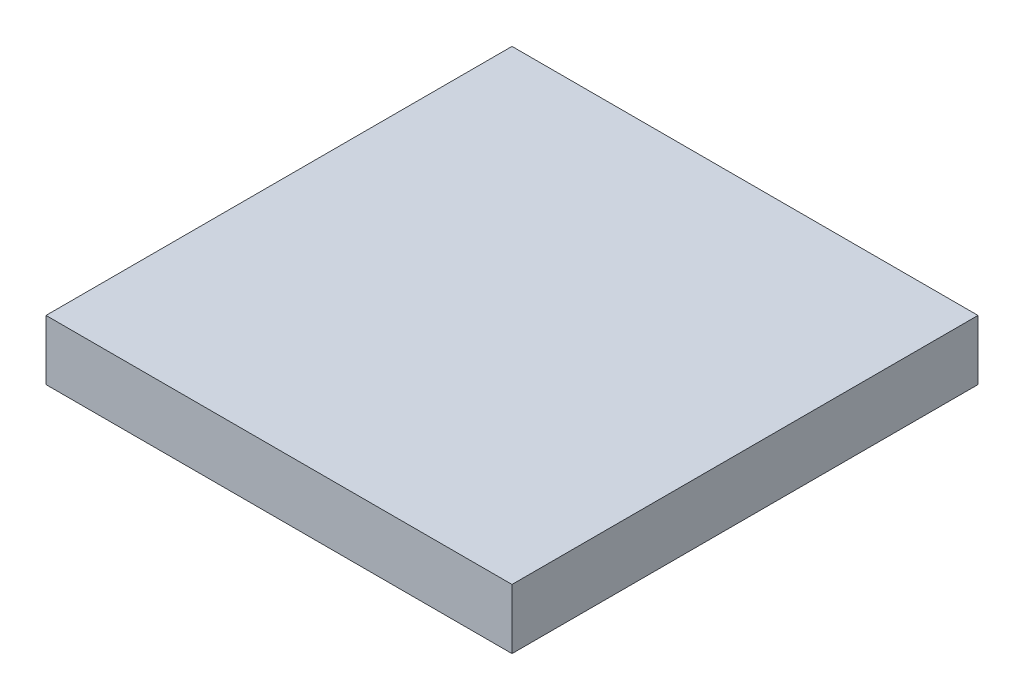
ISO-10303-21;
HEADER;
FILE_DESCRIPTION(('STEP AP214'),'2;1');
FILE_NAME('part.step','',(''),(''),'','','');
FILE_SCHEMA(('AUTOMOTIVE_DESIGN { 1 0 10303 214 1 1 1 1 }'));
ENDSEC;
DATA;
#1=APPLICATION_CONTEXT('core data for automotive mechanical design processes');
#2=APPLICATION_PROTOCOL_DEFINITION('international standard','automotive_design',2000,#1);
#3=PRODUCT_CONTEXT('',#1,'mechanical');
#4=PRODUCT('Part','Part','',(#3));
#5=PRODUCT_RELATED_PRODUCT_CATEGORY('part','',(#4));
#6=PRODUCT_DEFINITION_FORMATION('','',#4);
#7=PRODUCT_DEFINITION_CONTEXT('part definition',#1,'design');
#8=PRODUCT_DEFINITION('design','',#6,#7);
#9=PRODUCT_DEFINITION_SHAPE('','',#8);
#10=(LENGTH_UNIT() NAMED_UNIT(*) SI_UNIT(.MILLI.,.METRE.));
#11=(NAMED_UNIT(*) PLANE_ANGLE_UNIT() SI_UNIT($,.RADIAN.));
#12=(NAMED_UNIT(*) SI_UNIT($,.STERADIAN.) SOLID_ANGLE_UNIT());
#13=UNCERTAINTY_MEASURE_WITH_UNIT(LENGTH_MEASURE(1.E-05),#10,'distance_accuracy_value','');
#14=(GEOMETRIC_REPRESENTATION_CONTEXT(3) GLOBAL_UNCERTAINTY_ASSIGNED_CONTEXT((#13)) GLOBAL_UNIT_ASSIGNED_CONTEXT((#10,
#11,#12)) REPRESENTATION_CONTEXT('',''));
#15=CARTESIAN_POINT('',(0.,0.,0.));
#16=DIRECTION('',(0.,0.,1.));
#17=DIRECTION('',(1.,0.,0.));
#18=AXIS2_PLACEMENT_3D('',#15,#16,#17);
#19=CARTESIAN_POINT('',(3.5,0.9,-3.5));
#20=DIRECTION('',(-1.,0.,0.));
#21=DIRECTION('',(0.,0.,1.));
#22=AXIS2_PLACEMENT_3D('',#19,#20,#21);
#23=PLANE('',#22);
#24=DIRECTION('',(0.,0.,-1.));
#25=VECTOR('',#24,1.);
#26=CARTESIAN_POINT('',(3.5,0.,-3.5));
#27=LINE('',#26,#25);
#28=CARTESIAN_POINT('',(3.5,0.,3.5));
#29=VERTEX_POINT('',#28);
#30=CARTESIAN_POINT('',(3.5,0.,-3.5));
#31=VERTEX_POINT('',#30);
#32=EDGE_CURVE('E95',#29,#31,#27,.T.);
#33=ORIENTED_EDGE('',*,*,#32,.T.);
#34=DIRECTION('',(0.,-1.,0.));
#35=VECTOR('',#34,1.);
#36=CARTESIAN_POINT('',(3.5,0.9,-3.5));
#37=LINE('',#36,#35);
#38=CARTESIAN_POINT('',(3.5,0.9,-3.5));
#39=VERTEX_POINT('',#38);
#40=EDGE_CURVE('E11',#39,#31,#37,.T.);
#41=ORIENTED_EDGE('',*,*,#40,.F.);
#42=DIRECTION('',(0.,0.,-1.));
#43=VECTOR('',#42,1.);
#44=CARTESIAN_POINT('',(3.5,0.9,-3.5));
#45=LINE('',#44,#43);
#46=CARTESIAN_POINT('',(3.5,0.9,3.5));
#47=VERTEX_POINT('',#46);
#48=EDGE_CURVE('E83',#47,#39,#45,.T.);
#49=ORIENTED_EDGE('',*,*,#48,.F.);
#50=DIRECTION('',(0.,-1.,0.));
#51=VECTOR('',#50,1.);
#52=CARTESIAN_POINT('',(3.5,0.9,3.5));
#53=LINE('',#52,#51);
#54=EDGE_CURVE('E91',#47,#29,#53,.T.);
#55=ORIENTED_EDGE('',*,*,#54,.T.);
#56=EDGE_LOOP('',(#33,#41,#49,#55));
#57=FACE_BOUND('',#56,.T.);
#58=ADVANCED_FACE('F32',(#57),#23,.F.);
#59=CARTESIAN_POINT('',(-3.5,0.9,-3.5));
#60=DIRECTION('',(0.,0.,1.));
#61=DIRECTION('',(1.,0.,0.));
#62=AXIS2_PLACEMENT_3D('',#59,#60,#61);
#63=PLANE('',#62);
#64=DIRECTION('',(-1.,0.,0.));
#65=VECTOR('',#64,1.);
#66=CARTESIAN_POINT('',(-3.5,0.,-3.5));
#67=LINE('',#66,#65);
#68=CARTESIAN_POINT('',(-3.5,0.,-3.5));
#69=VERTEX_POINT('',#68);
#70=EDGE_CURVE('E87',#31,#69,#67,.T.);
#71=ORIENTED_EDGE('',*,*,#70,.T.);
#72=DIRECTION('',(0.,-1.,0.));
#73=VECTOR('',#72,1.);
#74=CARTESIAN_POINT('',(-3.5,0.9,-3.5));
#75=LINE('',#74,#73);
#76=CARTESIAN_POINT('',(-3.5,0.9,-3.5));
#77=VERTEX_POINT('',#76);
#78=EDGE_CURVE('E40',#77,#69,#75,.T.);
#79=ORIENTED_EDGE('',*,*,#78,.F.);
#80=DIRECTION('',(-1.,0.,0.));
#81=VECTOR('',#80,1.);
#82=CARTESIAN_POINT('',(-3.5,0.9,-3.5));
#83=LINE('',#82,#81);
#84=EDGE_CURVE('E78',#39,#77,#83,.T.);
#85=ORIENTED_EDGE('',*,*,#84,.F.);
#86=ORIENTED_EDGE('',*,*,#40,.T.);
#87=EDGE_LOOP('',(#71,#79,#85,#86));
#88=FACE_BOUND('',#87,.T.);
#89=ADVANCED_FACE('F86',(#88),#63,.F.);
#90=CARTESIAN_POINT('',(-3.5,0.9,-3.5));
#91=DIRECTION('',(1.,0.,0.));
#92=DIRECTION('',(0.,0.,-1.));
#93=AXIS2_PLACEMENT_3D('',#90,#91,#92);
#94=PLANE('',#93);
#95=DIRECTION('',(0.,0.,1.));
#96=VECTOR('',#95,1.);
#97=CARTESIAN_POINT('',(-3.5,0.,-3.5));
#98=LINE('',#97,#96);
#99=CARTESIAN_POINT('',(-3.5,0.,3.5));
#100=VERTEX_POINT('',#99);
#101=EDGE_CURVE('E65',#69,#100,#98,.T.);
#102=ORIENTED_EDGE('',*,*,#101,.T.);
#103=DIRECTION('',(0.,-1.,0.));
#104=VECTOR('',#103,1.);
#105=CARTESIAN_POINT('',(-3.5,0.9,3.5));
#106=LINE('',#105,#104);
#107=CARTESIAN_POINT('',(-3.5,0.9,3.5));
#108=VERTEX_POINT('',#107);
#109=EDGE_CURVE('E88',#108,#100,#106,.T.);
#110=ORIENTED_EDGE('',*,*,#109,.F.);
#111=DIRECTION('',(0.,0.,1.));
#112=VECTOR('',#111,1.);
#113=CARTESIAN_POINT('',(-3.5,0.9,-3.5));
#114=LINE('',#113,#112);
#115=EDGE_CURVE('E81',#77,#108,#114,.T.);
#116=ORIENTED_EDGE('',*,*,#115,.F.);
#117=ORIENTED_EDGE('',*,*,#78,.T.);
#118=EDGE_LOOP('',(#102,#110,#116,#117));
#119=FACE_BOUND('',#118,.T.);
#120=ADVANCED_FACE('F89',(#119),#94,.F.);
#121=CARTESIAN_POINT('',(-3.5,0.9,3.5));
#122=DIRECTION('',(0.,0.,-1.));
#123=DIRECTION('',(-1.,0.,0.));
#124=AXIS2_PLACEMENT_3D('',#121,#122,#123);
#125=PLANE('',#124);
#126=DIRECTION('',(1.,0.,0.));
#127=VECTOR('',#126,1.);
#128=CARTESIAN_POINT('',(-3.5,0.,3.5));
#129=LINE('',#128,#127);
#130=EDGE_CURVE('E71',#100,#29,#129,.T.);
#131=ORIENTED_EDGE('',*,*,#130,.T.);
#132=ORIENTED_EDGE('',*,*,#54,.F.);
#133=DIRECTION('',(1.,0.,0.));
#134=VECTOR('',#133,1.);
#135=CARTESIAN_POINT('',(-3.5,0.9,3.5));
#136=LINE('',#135,#134);
#137=EDGE_CURVE('E48',#108,#47,#136,.T.);
#138=ORIENTED_EDGE('',*,*,#137,.F.);
#139=ORIENTED_EDGE('',*,*,#109,.T.);
#140=EDGE_LOOP('',(#131,#132,#138,#139));
#141=FACE_BOUND('',#140,.T.);
#142=ADVANCED_FACE('F102',(#141),#125,.F.);
#143=CARTESIAN_POINT('',(0.,0.9,0.));
#144=DIRECTION('',(0.,1.,0.));
#145=DIRECTION('',(0.,0.,1.));
#146=AXIS2_PLACEMENT_3D('',#143,#144,#145);
#147=PLANE('',#146);
#148=ORIENTED_EDGE('',*,*,#48,.T.);
#149=ORIENTED_EDGE('',*,*,#84,.T.);
#150=ORIENTED_EDGE('',*,*,#115,.T.);
#151=ORIENTED_EDGE('',*,*,#137,.T.);
#152=EDGE_LOOP('',(#148,#149,#150,#151));
#153=FACE_BOUND('',#152,.T.);
#154=ADVANCED_FACE('F79',(#153),#147,.T.);
#155=CARTESIAN_POINT('',(0.,0.,0.));
#156=DIRECTION('',(0.,1.,0.));
#157=DIRECTION('',(0.,0.,1.));
#158=AXIS2_PLACEMENT_3D('',#155,#156,#157);
#159=PLANE('',#158);
#160=ORIENTED_EDGE('',*,*,#32,.F.);
#161=ORIENTED_EDGE('',*,*,#130,.F.);
#162=ORIENTED_EDGE('',*,*,#101,.F.);
#163=ORIENTED_EDGE('',*,*,#70,.F.);
#164=EDGE_LOOP('',(#160,#161,#162,#163));
#165=FACE_BOUND('',#164,.T.);
#166=ADVANCED_FACE('F105',(#165),#159,.F.);
#167=CLOSED_SHELL('',(#58,#89,#120,#142,#154,#166));
#168=MANIFOLD_SOLID_BREP('B2',#167);
#169=ADVANCED_BREP_SHAPE_REPRESENTATION('',(#18,#168),#14);
#170=SHAPE_DEFINITION_REPRESENTATION(#9,#169);
ENDSEC;
END-ISO-10303-21;
